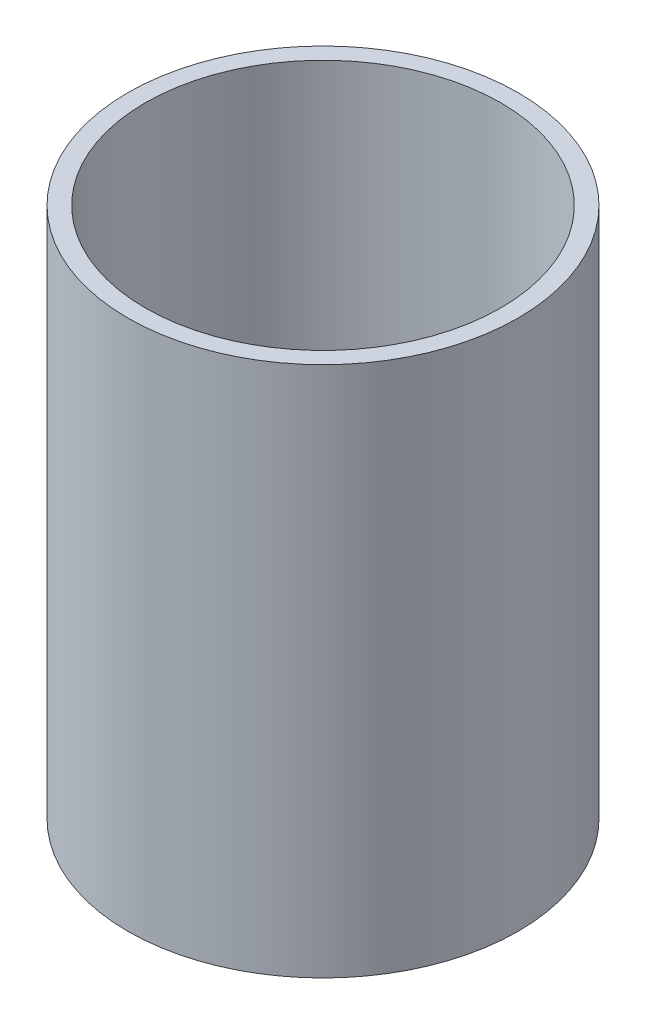
ISO-10303-21;
HEADER;
FILE_DESCRIPTION(('STEP AP214'),'2;1');
FILE_NAME('part.step','',(''),(''),'','','');
FILE_SCHEMA(('AUTOMOTIVE_DESIGN { 1 0 10303 214 1 1 1 1 }'));
ENDSEC;
DATA;
#1=APPLICATION_CONTEXT('core data for automotive mechanical design processes');
#2=APPLICATION_PROTOCOL_DEFINITION('international standard','automotive_design',2000,#1);
#3=PRODUCT_CONTEXT('',#1,'mechanical');
#4=PRODUCT('Part','Part','',(#3));
#5=PRODUCT_RELATED_PRODUCT_CATEGORY('part','',(#4));
#6=PRODUCT_DEFINITION_FORMATION('','',#4);
#7=PRODUCT_DEFINITION_CONTEXT('part definition',#1,'design');
#8=PRODUCT_DEFINITION('design','',#6,#7);
#9=PRODUCT_DEFINITION_SHAPE('','',#8);
#10=(LENGTH_UNIT() NAMED_UNIT(*) SI_UNIT(.MILLI.,.METRE.));
#11=(NAMED_UNIT(*) PLANE_ANGLE_UNIT() SI_UNIT($,.RADIAN.));
#12=(NAMED_UNIT(*) SI_UNIT($,.STERADIAN.) SOLID_ANGLE_UNIT());
#13=UNCERTAINTY_MEASURE_WITH_UNIT(LENGTH_MEASURE(1.E-05),#10,'distance_accuracy_value','');
#14=(GEOMETRIC_REPRESENTATION_CONTEXT(3) GLOBAL_UNCERTAINTY_ASSIGNED_CONTEXT((#13)) GLOBAL_UNIT_ASSIGNED_CONTEXT((#10,
#11,#12)) REPRESENTATION_CONTEXT('',''));
#15=CARTESIAN_POINT('',(0.,0.,0.));
#16=DIRECTION('',(0.,0.,1.));
#17=DIRECTION('',(1.,0.,0.));
#18=AXIS2_PLACEMENT_3D('',#15,#16,#17);
#19=CARTESIAN_POINT('',(25.5,0.,0.));
#20=DIRECTION('',(0.,1.,0.));
#21=DIRECTION('',(0.,0.,1.));
#22=AXIS2_PLACEMENT_3D('',#19,#20,#21);
#23=PLANE('',#22);
#24=CARTESIAN_POINT('',(0.,0.,0.));
#25=DIRECTION('',(0.,1.,0.));
#26=DIRECTION('',(0.,0.,1.));
#27=AXIS2_PLACEMENT_3D('',#24,#25,#26);
#28=CIRCLE('',#27,28.);
#29=CARTESIAN_POINT('',(0.,0.,28.));
#30=VERTEX_POINT('',#29);
#31=EDGE_CURVE('E12',#30,#30,#28,.T.);
#32=ORIENTED_EDGE('',*,*,#31,.F.);
#33=EDGE_LOOP('',(#32));
#34=FACE_BOUND('',#33,.T.);
#35=CARTESIAN_POINT('',(0.,0.,0.));
#36=DIRECTION('',(0.,1.,0.));
#37=DIRECTION('',(0.,0.,1.));
#38=AXIS2_PLACEMENT_3D('',#35,#36,#37);
#39=CIRCLE('',#38,25.5);
#40=CARTESIAN_POINT('',(0.,0.,25.5));
#41=VERTEX_POINT('',#40);
#42=EDGE_CURVE('E59',#41,#41,#39,.T.);
#43=ORIENTED_EDGE('',*,*,#42,.T.);
#44=EDGE_LOOP('',(#43));
#45=FACE_BOUND('',#44,.T.);
#46=ADVANCED_FACE('F45',(#34,#45),#23,.F.);
#47=CARTESIAN_POINT('',(0.,161.376166943427,0.));
#48=DIRECTION('',(0.,1.,0.));
#49=DIRECTION('',(0.,0.,1.));
#50=AXIS2_PLACEMENT_3D('',#47,#48,#49);
#51=CYLINDRICAL_SURFACE('',#50,28.);
#52=CARTESIAN_POINT('',(0.,76.2,0.));
#53=DIRECTION('',(0.,1.,0.));
#54=DIRECTION('',(0.,0.,1.));
#55=AXIS2_PLACEMENT_3D('',#52,#53,#54);
#56=CIRCLE('',#55,28.);
#57=CARTESIAN_POINT('',(0.,76.2,28.));
#58=VERTEX_POINT('',#57);
#59=EDGE_CURVE('E51',#58,#58,#56,.T.);
#60=ORIENTED_EDGE('',*,*,#59,.F.);
#61=EDGE_LOOP('',(#60));
#62=FACE_BOUND('',#61,.T.);
#63=ORIENTED_EDGE('',*,*,#31,.T.);
#64=EDGE_LOOP('',(#63));
#65=FACE_BOUND('',#64,.T.);
#66=ADVANCED_FACE('F74',(#62,#65),#51,.T.);
#67=CARTESIAN_POINT('',(25.5,76.2,0.));
#68=DIRECTION('',(0.,-1.,0.));
#69=DIRECTION('',(0.,0.,-1.));
#70=AXIS2_PLACEMENT_3D('',#67,#68,#69);
#71=PLANE('',#70);
#72=CARTESIAN_POINT('',(0.,76.2,0.));
#73=DIRECTION('',(0.,1.,0.));
#74=DIRECTION('',(0.,0.,1.));
#75=AXIS2_PLACEMENT_3D('',#72,#73,#74);
#76=CIRCLE('',#75,25.5);
#77=CARTESIAN_POINT('',(0.,76.2,25.5));
#78=VERTEX_POINT('',#77);
#79=EDGE_CURVE('E55',#78,#78,#76,.T.);
#80=ORIENTED_EDGE('',*,*,#79,.F.);
#81=EDGE_LOOP('',(#80));
#82=FACE_BOUND('',#81,.T.);
#83=ORIENTED_EDGE('',*,*,#59,.T.);
#84=EDGE_LOOP('',(#83));
#85=FACE_BOUND('',#84,.T.);
#86=ADVANCED_FACE('F69',(#82,#85),#71,.F.);
#87=CARTESIAN_POINT('',(0.,161.376166943427,0.));
#88=DIRECTION('',(0.,1.,0.));
#89=DIRECTION('',(0.,0.,1.));
#90=AXIS2_PLACEMENT_3D('',#87,#88,#89);
#91=CYLINDRICAL_SURFACE('',#90,25.5);
#92=ORIENTED_EDGE('',*,*,#42,.F.);
#93=EDGE_LOOP('',(#92));
#94=FACE_BOUND('',#93,.T.);
#95=ORIENTED_EDGE('',*,*,#79,.T.);
#96=EDGE_LOOP('',(#95));
#97=FACE_BOUND('',#96,.T.);
#98=ADVANCED_FACE('F66',(#94,#97),#91,.F.);
#99=CLOSED_SHELL('',(#46,#66,#86,#98));
#100=MANIFOLD_SOLID_BREP('B2',#99);
#101=ADVANCED_BREP_SHAPE_REPRESENTATION('',(#18,#100),#14);
#102=SHAPE_DEFINITION_REPRESENTATION(#9,#101);
ENDSEC;
END-ISO-10303-21;
